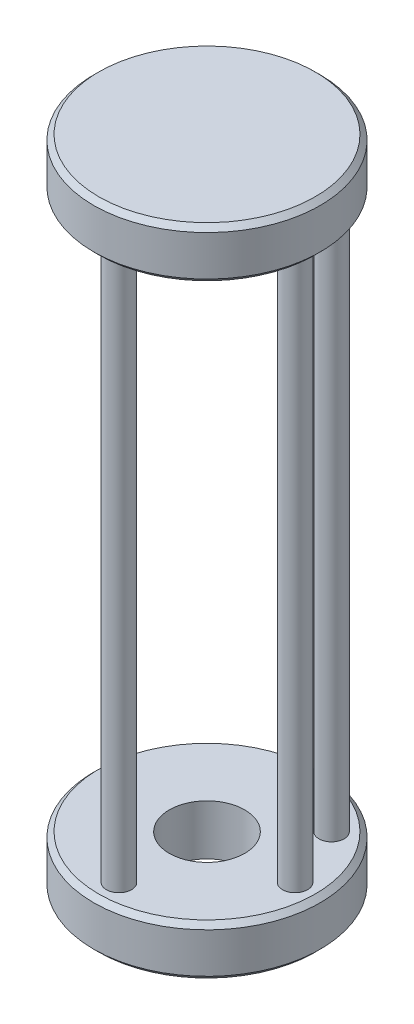
ISO-10303-21;
HEADER;
FILE_DESCRIPTION(('STEP AP214'),'2;1');
FILE_NAME('part.step','',(''),(''),'','','');
FILE_SCHEMA(('AUTOMOTIVE_DESIGN { 1 0 10303 214 1 1 1 1 }'));
ENDSEC;
DATA;
#1=APPLICATION_CONTEXT('core data for automotive mechanical design processes');
#2=APPLICATION_PROTOCOL_DEFINITION('international standard','automotive_design',2000,#1);
#3=PRODUCT_CONTEXT('',#1,'mechanical');
#4=PRODUCT('Part','Part','',(#3));
#5=PRODUCT_RELATED_PRODUCT_CATEGORY('part','',(#4));
#6=PRODUCT_DEFINITION_FORMATION('','',#4);
#7=PRODUCT_DEFINITION_CONTEXT('part definition',#1,'design');
#8=PRODUCT_DEFINITION('design','',#6,#7);
#9=PRODUCT_DEFINITION_SHAPE('','',#8);
#10=(LENGTH_UNIT() NAMED_UNIT(*) SI_UNIT(.MILLI.,.METRE.));
#11=(NAMED_UNIT(*) PLANE_ANGLE_UNIT() SI_UNIT($,.RADIAN.));
#12=(NAMED_UNIT(*) SI_UNIT($,.STERADIAN.) SOLID_ANGLE_UNIT());
#13=UNCERTAINTY_MEASURE_WITH_UNIT(LENGTH_MEASURE(1.E-05),#10,'distance_accuracy_value','');
#14=(GEOMETRIC_REPRESENTATION_CONTEXT(3) GLOBAL_UNCERTAINTY_ASSIGNED_CONTEXT((#13)) GLOBAL_UNIT_ASSIGNED_CONTEXT((#10,
#11,#12)) REPRESENTATION_CONTEXT('',''));
#15=CARTESIAN_POINT('',(0.,0.,0.));
#16=DIRECTION('',(0.,0.,1.));
#17=DIRECTION('',(1.,0.,0.));
#18=AXIS2_PLACEMENT_3D('',#15,#16,#17);
#19=CARTESIAN_POINT('',(0.,20.,0.));
#20=DIRECTION('',(0.,-1.,0.));
#21=DIRECTION('',(0.,0.,-1.));
#22=AXIS2_PLACEMENT_3D('',#19,#20,#21);
#23=CYLINDRICAL_SURFACE('',#22,45.);
#24=CARTESIAN_POINT('',(0.,2.00000000000003,0.));
#25=DIRECTION('',(0.,1.,0.));
#26=DIRECTION('',(0.,0.,1.));
#27=AXIS2_PLACEMENT_3D('',#24,#25,#26);
#28=CIRCLE('',#27,45.);
#29=CARTESIAN_POINT('',(0.,2.00000000000003,45.));
#30=VERTEX_POINT('',#29);
#31=EDGE_CURVE('E62',#30,#30,#28,.T.);
#32=ORIENTED_EDGE('',*,*,#31,.T.);
#33=EDGE_LOOP('',(#32));
#34=FACE_BOUND('',#33,.T.);
#35=CARTESIAN_POINT('',(0.,18.,0.));
#36=DIRECTION('',(0.,1.,0.));
#37=DIRECTION('',(0.,0.,1.));
#38=AXIS2_PLACEMENT_3D('',#35,#36,#37);
#39=CIRCLE('',#38,45.);
#40=CARTESIAN_POINT('',(0.,18.,45.));
#41=VERTEX_POINT('',#40);
#42=EDGE_CURVE('E65',#41,#41,#39,.F.);
#43=ORIENTED_EDGE('',*,*,#42,.T.);
#44=EDGE_LOOP('',(#43));
#45=FACE_BOUND('',#44,.T.);
#46=ADVANCED_FACE('F35',(#34,#45),#23,.T.);
#47=CARTESIAN_POINT('',(0.,20.,0.));
#48=DIRECTION('',(0.,1.,0.));
#49=DIRECTION('',(0.,0.,1.));
#50=AXIS2_PLACEMENT_3D('',#47,#48,#49);
#51=PLANE('',#50);
#52=CARTESIAN_POINT('',(0.,20.,0.));
#53=DIRECTION('',(0.,1.,0.));
#54=DIRECTION('',(0.,0.,1.));
#55=AXIS2_PLACEMENT_3D('',#52,#53,#54);
#56=CIRCLE('',#55,43.);
#57=CARTESIAN_POINT('',(0.,20.,43.));
#58=VERTEX_POINT('',#57);
#59=EDGE_CURVE('E56',#58,#58,#56,.T.);
#60=ORIENTED_EDGE('',*,*,#59,.T.);
#61=EDGE_LOOP('',(#60));
#62=FACE_BOUND('',#61,.T.);
#63=CARTESIAN_POINT('',(24.7487373415291,20.,-24.7487373415292));
#64=DIRECTION('',(0.,1.,0.));
#65=DIRECTION('',(0.,0.,1.));
#66=AXIS2_PLACEMENT_3D('',#63,#64,#65);
#67=CIRCLE('',#66,5.);
#68=CARTESIAN_POINT('',(24.7487373415291,20.,-19.7487373415292));
#69=VERTEX_POINT('',#68);
#70=EDGE_CURVE('E99',#69,#69,#67,.T.);
#71=ORIENTED_EDGE('',*,*,#70,.F.);
#72=EDGE_LOOP('',(#71));
#73=FACE_BOUND('',#72,.T.);
#74=CARTESIAN_POINT('',(3.66605540578529E-13,20.,-35.));
#75=DIRECTION('',(0.,1.,0.));
#76=DIRECTION('',(0.,0.,1.));
#77=AXIS2_PLACEMENT_3D('',#74,#75,#76);
#78=CIRCLE('',#77,5.);
#79=CARTESIAN_POINT('',(3.66605540578529E-13,20.,-30.));
#80=VERTEX_POINT('',#79);
#81=EDGE_CURVE('E93',#80,#80,#78,.T.);
#82=ORIENTED_EDGE('',*,*,#81,.F.);
#83=EDGE_LOOP('',(#82));
#84=FACE_BOUND('',#83,.T.);
#85=CARTESIAN_POINT('',(-35.,20.,-2.44403693719019E-13));
#86=DIRECTION('',(0.,1.,0.));
#87=DIRECTION('',(0.,0.,1.));
#88=AXIS2_PLACEMENT_3D('',#85,#86,#87);
#89=CIRCLE('',#88,4.99999999999999);
#90=CARTESIAN_POINT('',(-35.,20.,4.99999999999975));
#91=VERTEX_POINT('',#90);
#92=EDGE_CURVE('E87',#91,#91,#89,.T.);
#93=ORIENTED_EDGE('',*,*,#92,.F.);
#94=EDGE_LOOP('',(#93));
#95=FACE_BOUND('',#94,.T.);
#96=CARTESIAN_POINT('',(-1.2220184685951E-13,20.,35.));
#97=DIRECTION('',(0.,1.,0.));
#98=DIRECTION('',(0.,0.,1.));
#99=AXIS2_PLACEMENT_3D('',#96,#97,#98);
#100=CIRCLE('',#99,5.);
#101=CARTESIAN_POINT('',(-1.2220184685951E-13,20.,40.));
#102=VERTEX_POINT('',#101);
#103=EDGE_CURVE('E81',#102,#102,#100,.T.);
#104=ORIENTED_EDGE('',*,*,#103,.F.);
#105=EDGE_LOOP('',(#104));
#106=FACE_BOUND('',#105,.T.);
#107=CARTESIAN_POINT('',(35.,20.,0.));
#108=DIRECTION('',(0.,1.,0.));
#109=DIRECTION('',(0.,0.,1.));
#110=AXIS2_PLACEMENT_3D('',#107,#108,#109);
#111=CIRCLE('',#110,5.);
#112=CARTESIAN_POINT('',(35.,20.,5.));
#113=VERTEX_POINT('',#112);
#114=EDGE_CURVE('E75',#113,#113,#111,.T.);
#115=ORIENTED_EDGE('',*,*,#114,.F.);
#116=EDGE_LOOP('',(#115));
#117=FACE_BOUND('',#116,.T.);
#118=CARTESIAN_POINT('',(0.,20.,0.));
#119=DIRECTION('',(0.,1.,0.));
#120=DIRECTION('',(0.,0.,1.));
#121=AXIS2_PLACEMENT_3D('',#118,#119,#120);
#122=CIRCLE('',#121,15.);
#123=CARTESIAN_POINT('',(0.,20.,15.));
#124=VERTEX_POINT('',#123);
#125=EDGE_CURVE('E69',#124,#124,#122,.T.);
#126=ORIENTED_EDGE('',*,*,#125,.F.);
#127=EDGE_LOOP('',(#126));
#128=FACE_BOUND('',#127,.T.);
#129=ADVANCED_FACE('F115',(#62,#73,#84,#95,#106,#117,#128),#51,.T.);
#130=CARTESIAN_POINT('',(0.,0.,0.));
#131=DIRECTION('',(0.,1.,0.));
#132=DIRECTION('',(0.,0.,1.));
#133=AXIS2_PLACEMENT_3D('',#130,#131,#132);
#134=PLANE('',#133);
#135=CARTESIAN_POINT('',(0.,0.,0.));
#136=DIRECTION('',(0.,1.,0.));
#137=DIRECTION('',(0.,0.,1.));
#138=AXIS2_PLACEMENT_3D('',#135,#136,#137);
#139=CIRCLE('',#138,43.);
#140=CARTESIAN_POINT('',(0.,0.,43.));
#141=VERTEX_POINT('',#140);
#142=EDGE_CURVE('E59',#141,#141,#139,.F.);
#143=ORIENTED_EDGE('',*,*,#142,.T.);
#144=EDGE_LOOP('',(#143));
#145=FACE_BOUND('',#144,.T.);
#146=CARTESIAN_POINT('',(0.,0.,0.));
#147=DIRECTION('',(0.,1.,0.));
#148=DIRECTION('',(0.,0.,1.));
#149=AXIS2_PLACEMENT_3D('',#146,#147,#148);
#150=CIRCLE('',#149,15.);
#151=CARTESIAN_POINT('',(0.,0.,15.));
#152=VERTEX_POINT('',#151);
#153=EDGE_CURVE('E68',#152,#152,#150,.T.);
#154=ORIENTED_EDGE('',*,*,#153,.T.);
#155=EDGE_LOOP('',(#154));
#156=FACE_BOUND('',#155,.T.);
#157=ADVANCED_FACE('F118',(#145,#156),#134,.F.);
#158=CARTESIAN_POINT('',(0.,0.,0.));
#159=DIRECTION('',(0.,1.,0.));
#160=DIRECTION('',(0.,0.,1.));
#161=AXIS2_PLACEMENT_3D('',#158,#159,#160);
#162=CYLINDRICAL_SURFACE('',#161,15.);
#163=ORIENTED_EDGE('',*,*,#153,.F.);
#164=EDGE_LOOP('',(#163));
#165=FACE_BOUND('',#164,.T.);
#166=ORIENTED_EDGE('',*,*,#125,.T.);
#167=EDGE_LOOP('',(#166));
#168=FACE_BOUND('',#167,.T.);
#169=ADVANCED_FACE('F131',(#165,#168),#162,.F.);
#170=CARTESIAN_POINT('',(35.,240.,0.));
#171=DIRECTION('',(0.,-1.,0.));
#172=DIRECTION('',(0.,0.,-1.));
#173=AXIS2_PLACEMENT_3D('',#170,#171,#172);
#174=CYLINDRICAL_SURFACE('',#173,5.);
#175=CARTESIAN_POINT('',(35.,240.,0.));
#176=DIRECTION('',(0.,1.,0.));
#177=DIRECTION('',(0.,0.,1.));
#178=AXIS2_PLACEMENT_3D('',#175,#176,#177);
#179=CIRCLE('',#178,5.);
#180=CARTESIAN_POINT('',(35.,240.,5.));
#181=VERTEX_POINT('',#180);
#182=EDGE_CURVE('E72',#181,#181,#179,.T.);
#183=ORIENTED_EDGE('',*,*,#182,.F.);
#184=EDGE_LOOP('',(#183));
#185=FACE_BOUND('',#184,.T.);
#186=ORIENTED_EDGE('',*,*,#114,.T.);
#187=EDGE_LOOP('',(#186));
#188=FACE_BOUND('',#187,.T.);
#189=ADVANCED_FACE('F133',(#185,#188),#174,.T.);
#190=CARTESIAN_POINT('',(-1.2220184685951E-13,240.,35.));
#191=DIRECTION('',(0.,-1.,0.));
#192=DIRECTION('',(0.,0.,-1.));
#193=AXIS2_PLACEMENT_3D('',#190,#191,#192);
#194=CYLINDRICAL_SURFACE('',#193,5.);
#195=CARTESIAN_POINT('',(-1.2220184685951E-13,240.,35.));
#196=DIRECTION('',(0.,1.,0.));
#197=DIRECTION('',(0.,0.,1.));
#198=AXIS2_PLACEMENT_3D('',#195,#196,#197);
#199=CIRCLE('',#198,5.);
#200=CARTESIAN_POINT('',(-1.2220184685951E-13,240.,40.));
#201=VERTEX_POINT('',#200);
#202=EDGE_CURVE('E78',#201,#201,#199,.T.);
#203=ORIENTED_EDGE('',*,*,#202,.F.);
#204=EDGE_LOOP('',(#203));
#205=FACE_BOUND('',#204,.T.);
#206=ORIENTED_EDGE('',*,*,#103,.T.);
#207=EDGE_LOOP('',(#206));
#208=FACE_BOUND('',#207,.T.);
#209=ADVANCED_FACE('F140',(#205,#208),#194,.T.);
#210=CARTESIAN_POINT('',(-35.,240.,-2.44403693719019E-13));
#211=DIRECTION('',(0.,-1.,0.));
#212=DIRECTION('',(0.,0.,-1.));
#213=AXIS2_PLACEMENT_3D('',#210,#211,#212);
#214=CYLINDRICAL_SURFACE('',#213,4.99999999999999);
#215=CARTESIAN_POINT('',(-35.,240.,-2.44403693719019E-13));
#216=DIRECTION('',(0.,1.,0.));
#217=DIRECTION('',(0.,0.,1.));
#218=AXIS2_PLACEMENT_3D('',#215,#216,#217);
#219=CIRCLE('',#218,4.99999999999999);
#220=CARTESIAN_POINT('',(-35.,240.,4.99999999999975));
#221=VERTEX_POINT('',#220);
#222=EDGE_CURVE('E84',#221,#221,#219,.T.);
#223=ORIENTED_EDGE('',*,*,#222,.F.);
#224=EDGE_LOOP('',(#223));
#225=FACE_BOUND('',#224,.T.);
#226=ORIENTED_EDGE('',*,*,#92,.T.);
#227=EDGE_LOOP('',(#226));
#228=FACE_BOUND('',#227,.T.);
#229=ADVANCED_FACE('F193',(#225,#228),#214,.T.);
#230=CARTESIAN_POINT('',(3.66605540578529E-13,240.,-35.));
#231=DIRECTION('',(0.,-1.,0.));
#232=DIRECTION('',(0.,0.,-1.));
#233=AXIS2_PLACEMENT_3D('',#230,#231,#232);
#234=CYLINDRICAL_SURFACE('',#233,5.);
#235=CARTESIAN_POINT('',(3.66605540578529E-13,240.,-35.));
#236=DIRECTION('',(0.,1.,0.));
#237=DIRECTION('',(0.,0.,1.));
#238=AXIS2_PLACEMENT_3D('',#235,#236,#237);
#239=CIRCLE('',#238,5.);
#240=CARTESIAN_POINT('',(3.66605540578529E-13,240.,-30.));
#241=VERTEX_POINT('',#240);
#242=EDGE_CURVE('E90',#241,#241,#239,.T.);
#243=ORIENTED_EDGE('',*,*,#242,.F.);
#244=EDGE_LOOP('',(#243));
#245=FACE_BOUND('',#244,.T.);
#246=ORIENTED_EDGE('',*,*,#81,.T.);
#247=EDGE_LOOP('',(#246));
#248=FACE_BOUND('',#247,.T.);
#249=ADVANCED_FACE('F111',(#245,#248),#234,.T.);
#250=CARTESIAN_POINT('',(24.7487373415291,240.,-24.7487373415292));
#251=DIRECTION('',(0.,-1.,0.));
#252=DIRECTION('',(0.,0.,-1.));
#253=AXIS2_PLACEMENT_3D('',#250,#251,#252);
#254=CYLINDRICAL_SURFACE('',#253,5.);
#255=CARTESIAN_POINT('',(24.7487373415291,240.,-24.7487373415292));
#256=DIRECTION('',(0.,1.,0.));
#257=DIRECTION('',(0.,0.,1.));
#258=AXIS2_PLACEMENT_3D('',#255,#256,#257);
#259=CIRCLE('',#258,5.);
#260=CARTESIAN_POINT('',(24.7487373415291,240.,-19.7487373415292));
#261=VERTEX_POINT('',#260);
#262=EDGE_CURVE('E96',#261,#261,#259,.T.);
#263=ORIENTED_EDGE('',*,*,#262,.F.);
#264=EDGE_LOOP('',(#263));
#265=FACE_BOUND('',#264,.T.);
#266=ORIENTED_EDGE('',*,*,#70,.T.);
#267=EDGE_LOOP('',(#266));
#268=FACE_BOUND('',#267,.T.);
#269=ADVANCED_FACE('F107',(#265,#268),#254,.T.);
#270=CARTESIAN_POINT('',(0.,260.,0.));
#271=DIRECTION('',(0.,-1.,0.));
#272=DIRECTION('',(0.,0.,-1.));
#273=AXIS2_PLACEMENT_3D('',#270,#271,#272);
#274=CYLINDRICAL_SURFACE('',#273,45.);
#275=CARTESIAN_POINT('',(0.,242.,0.));
#276=DIRECTION('',(0.,1.,0.));
#277=DIRECTION('',(0.,0.,1.));
#278=AXIS2_PLACEMENT_3D('',#275,#276,#277);
#279=CIRCLE('',#278,45.);
#280=CARTESIAN_POINT('',(0.,242.,45.));
#281=VERTEX_POINT('',#280);
#282=EDGE_CURVE('E47',#281,#281,#279,.T.);
#283=ORIENTED_EDGE('',*,*,#282,.T.);
#284=EDGE_LOOP('',(#283));
#285=FACE_BOUND('',#284,.T.);
#286=CARTESIAN_POINT('',(0.,258.,0.));
#287=DIRECTION('',(0.,1.,0.));
#288=DIRECTION('',(0.,0.,1.));
#289=AXIS2_PLACEMENT_3D('',#286,#287,#288);
#290=CIRCLE('',#289,45.);
#291=CARTESIAN_POINT('',(0.,258.,45.));
#292=VERTEX_POINT('',#291);
#293=EDGE_CURVE('E51',#292,#292,#290,.F.);
#294=ORIENTED_EDGE('',*,*,#293,.T.);
#295=EDGE_LOOP('',(#294));
#296=FACE_BOUND('',#295,.T.);
#297=ADVANCED_FACE('F110',(#285,#296),#274,.T.);
#298=CARTESIAN_POINT('',(0.,260.,0.));
#299=DIRECTION('',(0.,1.,0.));
#300=DIRECTION('',(0.,0.,1.));
#301=AXIS2_PLACEMENT_3D('',#298,#299,#300);
#302=PLANE('',#301);
#303=CARTESIAN_POINT('',(0.,260.,0.));
#304=DIRECTION('',(0.,1.,0.));
#305=DIRECTION('',(0.,0.,1.));
#306=AXIS2_PLACEMENT_3D('',#303,#304,#305);
#307=CIRCLE('',#306,43.);
#308=CARTESIAN_POINT('',(0.,260.,43.));
#309=VERTEX_POINT('',#308);
#310=EDGE_CURVE('E10',#309,#309,#307,.T.);
#311=ORIENTED_EDGE('',*,*,#310,.T.);
#312=EDGE_LOOP('',(#311));
#313=FACE_BOUND('',#312,.T.);
#314=ADVANCED_FACE('F181',(#313),#302,.T.);
#315=CARTESIAN_POINT('',(0.,240.,0.));
#316=DIRECTION('',(0.,1.,0.));
#317=DIRECTION('',(0.,0.,1.));
#318=AXIS2_PLACEMENT_3D('',#315,#316,#317);
#319=PLANE('',#318);
#320=CARTESIAN_POINT('',(0.,240.,0.));
#321=DIRECTION('',(0.,1.,0.));
#322=DIRECTION('',(0.,0.,1.));
#323=AXIS2_PLACEMENT_3D('',#320,#321,#322);
#324=CIRCLE('',#323,43.0000000000001);
#325=CARTESIAN_POINT('',(0.,240.,43.0000000000001));
#326=VERTEX_POINT('',#325);
#327=EDGE_CURVE('E43',#326,#326,#324,.F.);
#328=ORIENTED_EDGE('',*,*,#327,.T.);
#329=EDGE_LOOP('',(#328));
#330=FACE_BOUND('',#329,.T.);
#331=ORIENTED_EDGE('',*,*,#182,.T.);
#332=EDGE_LOOP('',(#331));
#333=FACE_BOUND('',#332,.T.);
#334=ORIENTED_EDGE('',*,*,#202,.T.);
#335=EDGE_LOOP('',(#334));
#336=FACE_BOUND('',#335,.T.);
#337=ORIENTED_EDGE('',*,*,#222,.T.);
#338=EDGE_LOOP('',(#337));
#339=FACE_BOUND('',#338,.T.);
#340=ORIENTED_EDGE('',*,*,#242,.T.);
#341=EDGE_LOOP('',(#340));
#342=FACE_BOUND('',#341,.T.);
#343=ORIENTED_EDGE('',*,*,#262,.T.);
#344=EDGE_LOOP('',(#343));
#345=FACE_BOUND('',#344,.T.);
#346=ADVANCED_FACE('F105',(#330,#333,#336,#339,#342,#345),#319,.F.);
#347=CARTESIAN_POINT('',(0.,2.00000000000003,0.));
#348=DIRECTION('',(0.,1.,0.));
#349=DIRECTION('',(0.,0.,1.));
#350=AXIS2_PLACEMENT_3D('',#347,#348,#349);
#351=CONICAL_SURFACE('',#350,45.,0.785398163397448);
#352=ORIENTED_EDGE('',*,*,#142,.F.);
#353=EDGE_LOOP('',(#352));
#354=FACE_BOUND('',#353,.T.);
#355=ORIENTED_EDGE('',*,*,#31,.F.);
#356=EDGE_LOOP('',(#355));
#357=FACE_BOUND('',#356,.T.);
#358=ADVANCED_FACE('F154',(#354,#357),#351,.T.);
#359=CARTESIAN_POINT('',(0.,20.,0.));
#360=DIRECTION('',(0.,-1.,0.));
#361=DIRECTION('',(0.,0.,-1.));
#362=AXIS2_PLACEMENT_3D('',#359,#360,#361);
#363=CONICAL_SURFACE('',#362,43.,0.78539816339745);
#364=ORIENTED_EDGE('',*,*,#42,.F.);
#365=EDGE_LOOP('',(#364));
#366=FACE_BOUND('',#365,.T.);
#367=ORIENTED_EDGE('',*,*,#59,.F.);
#368=EDGE_LOOP('',(#367));
#369=FACE_BOUND('',#368,.T.);
#370=ADVANCED_FACE('F160',(#366,#369),#363,.T.);
#371=CARTESIAN_POINT('',(0.,242.,0.));
#372=DIRECTION('',(0.,1.,0.));
#373=DIRECTION('',(0.,0.,1.));
#374=AXIS2_PLACEMENT_3D('',#371,#372,#373);
#375=CONICAL_SURFACE('',#374,45.,0.785398163397452);
#376=ORIENTED_EDGE('',*,*,#327,.F.);
#377=EDGE_LOOP('',(#376));
#378=FACE_BOUND('',#377,.T.);
#379=ORIENTED_EDGE('',*,*,#282,.F.);
#380=EDGE_LOOP('',(#379));
#381=FACE_BOUND('',#380,.T.);
#382=ADVANCED_FACE('F166',(#378,#381),#375,.T.);
#383=CARTESIAN_POINT('',(0.,260.,0.));
#384=DIRECTION('',(0.,-1.,0.));
#385=DIRECTION('',(0.,0.,-1.));
#386=AXIS2_PLACEMENT_3D('',#383,#384,#385);
#387=CONICAL_SURFACE('',#386,43.,0.78539816339746);
#388=ORIENTED_EDGE('',*,*,#293,.F.);
#389=EDGE_LOOP('',(#388));
#390=FACE_BOUND('',#389,.T.);
#391=ORIENTED_EDGE('',*,*,#310,.F.);
#392=EDGE_LOOP('',(#391));
#393=FACE_BOUND('',#392,.T.);
#394=ADVANCED_FACE('F38',(#390,#393),#387,.T.);
#395=CLOSED_SHELL('',(#46,#129,#157,#169,#189,#209,#229,#249,#269,#297,#314,#346,#358,#370,#382,#394));
#396=MANIFOLD_SOLID_BREP('B2',#395);
#397=ADVANCED_BREP_SHAPE_REPRESENTATION('',(#18,#396),#14);
#398=SHAPE_DEFINITION_REPRESENTATION(#9,#397);
ENDSEC;
END-ISO-10303-21;
